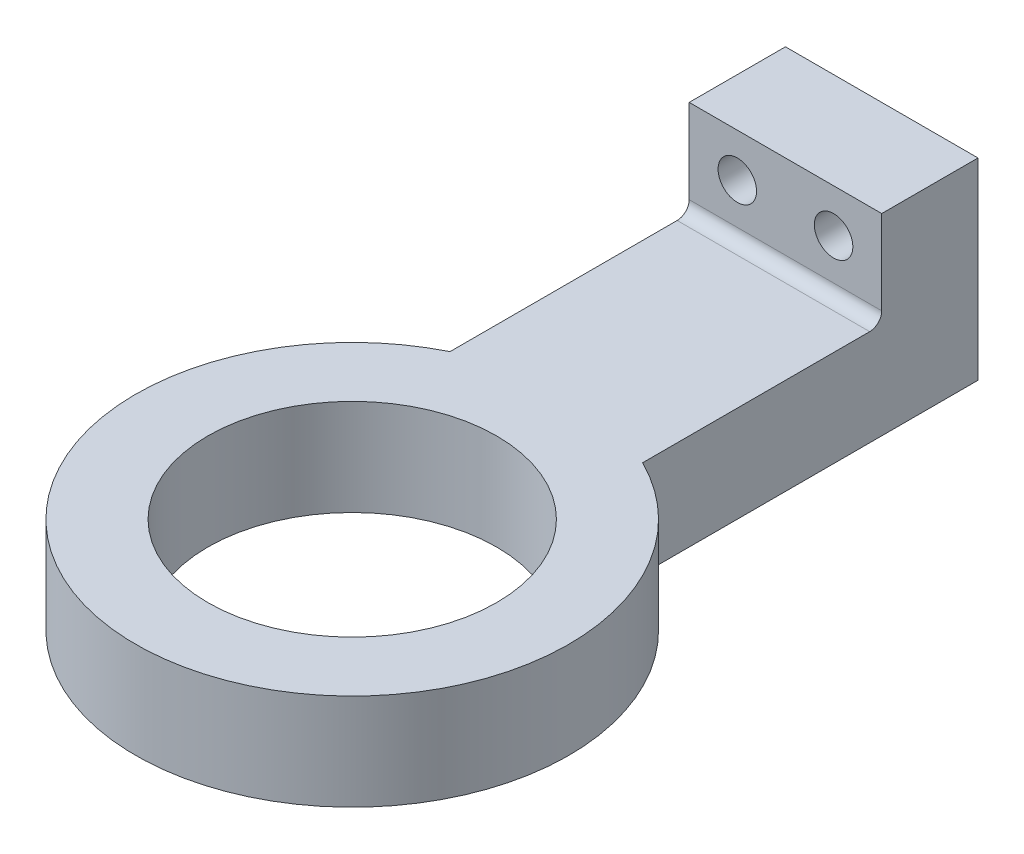
ISO-10303-21;
HEADER;
FILE_DESCRIPTION(('STEP AP214'),'2;1');
FILE_NAME('part.step','',(''),(''),'','','');
FILE_SCHEMA(('AUTOMOTIVE_DESIGN { 1 0 10303 214 1 1 1 1 }'));
ENDSEC;
DATA;
#1=APPLICATION_CONTEXT('core data for automotive mechanical design processes');
#2=APPLICATION_PROTOCOL_DEFINITION('international standard','automotive_design',2000,#1);
#3=PRODUCT_CONTEXT('',#1,'mechanical');
#4=PRODUCT('Part','Part','',(#3));
#5=PRODUCT_RELATED_PRODUCT_CATEGORY('part','',(#4));
#6=PRODUCT_DEFINITION_FORMATION('','',#4);
#7=PRODUCT_DEFINITION_CONTEXT('part definition',#1,'design');
#8=PRODUCT_DEFINITION('design','',#6,#7);
#9=PRODUCT_DEFINITION_SHAPE('','',#8);
#10=(LENGTH_UNIT() NAMED_UNIT(*) SI_UNIT(.MILLI.,.METRE.));
#11=(NAMED_UNIT(*) PLANE_ANGLE_UNIT() SI_UNIT($,.RADIAN.));
#12=(NAMED_UNIT(*) SI_UNIT($,.STERADIAN.) SOLID_ANGLE_UNIT());
#13=UNCERTAINTY_MEASURE_WITH_UNIT(LENGTH_MEASURE(1.E-05),#10,'distance_accuracy_value','');
#14=(GEOMETRIC_REPRESENTATION_CONTEXT(3) GLOBAL_UNCERTAINTY_ASSIGNED_CONTEXT((#13)) GLOBAL_UNIT_ASSIGNED_CONTEXT((#10,
#11,#12)) REPRESENTATION_CONTEXT('',''));
#15=CARTESIAN_POINT('',(0.,0.,0.));
#16=DIRECTION('',(0.,0.,1.));
#17=DIRECTION('',(1.,0.,0.));
#18=AXIS2_PLACEMENT_3D('',#15,#16,#17);
#19=CARTESIAN_POINT('',(0.,20.,0.));
#20=DIRECTION('',(0.,-1.,0.));
#21=DIRECTION('',(0.,0.,-1.));
#22=AXIS2_PLACEMENT_3D('',#19,#20,#21);
#23=CYLINDRICAL_SURFACE('',#22,45.);
#24=DIRECTION('',(0.,-1.,0.));
#25=VECTOR('',#24,1.);
#26=CARTESIAN_POINT('',(20.,20.,-40.3112887414927));
#27=LINE('',#26,#25);
#28=CARTESIAN_POINT('',(20.,20.,-40.3112887414927));
#29=VERTEX_POINT('',#28);
#30=CARTESIAN_POINT('',(20.,0.,-40.3112887414927));
#31=VERTEX_POINT('',#30);
#32=EDGE_CURVE('E151',#29,#31,#27,.T.);
#33=ORIENTED_EDGE('',*,*,#32,.F.);
#34=CARTESIAN_POINT('',(0.,20.,0.));
#35=DIRECTION('',(0.,1.,0.));
#36=DIRECTION('',(0.,0.,1.));
#37=AXIS2_PLACEMENT_3D('',#34,#35,#36);
#38=CIRCLE('',#37,45.);
#39=CARTESIAN_POINT('',(-20.,20.,-40.3112887414927));
#40=VERTEX_POINT('',#39);
#41=EDGE_CURVE('E143',#40,#29,#38,.T.);
#42=ORIENTED_EDGE('',*,*,#41,.F.);
#43=DIRECTION('',(0.,-1.,0.));
#44=VECTOR('',#43,1.);
#45=CARTESIAN_POINT('',(-20.,20.,-40.3112887414927));
#46=LINE('',#45,#44);
#47=CARTESIAN_POINT('',(-20.,0.,-40.3112887414927));
#48=VERTEX_POINT('',#47);
#49=EDGE_CURVE('E146',#48,#40,#46,.F.);
#50=ORIENTED_EDGE('',*,*,#49,.F.);
#51=CARTESIAN_POINT('',(0.,0.,0.));
#52=DIRECTION('',(0.,1.,0.));
#53=DIRECTION('',(0.,0.,1.));
#54=AXIS2_PLACEMENT_3D('',#51,#52,#53);
#55=CIRCLE('',#54,45.);
#56=EDGE_CURVE('E140',#48,#31,#55,.T.);
#57=ORIENTED_EDGE('',*,*,#56,.T.);
#58=EDGE_LOOP('',(#33,#42,#50,#57));
#59=FACE_BOUND('',#58,.T.);
#60=ADVANCED_FACE('F33',(#59),#23,.T.);
#61=CARTESIAN_POINT('',(0.,20.,0.));
#62=DIRECTION('',(0.,1.,0.));
#63=DIRECTION('',(0.,0.,1.));
#64=AXIS2_PLACEMENT_3D('',#61,#62,#63);
#65=PLANE('',#64);
#66=DIRECTION('',(0.,0.,-1.));
#67=VECTOR('',#66,1.);
#68=CARTESIAN_POINT('',(20.,20.,-110.));
#69=LINE('',#68,#67);
#70=CARTESIAN_POINT('',(20.,20.,-87.5));
#71=VERTEX_POINT('',#70);
#72=EDGE_CURVE('E129',#29,#71,#69,.T.);
#73=ORIENTED_EDGE('',*,*,#72,.T.);
#74=DIRECTION('',(1.,0.,0.));
#75=VECTOR('',#74,1.);
#76=CARTESIAN_POINT('',(0.,20.,-87.5));
#77=LINE('',#76,#75);
#78=CARTESIAN_POINT('',(-20.,20.,-87.5));
#79=VERTEX_POINT('',#78);
#80=EDGE_CURVE('E54',#71,#79,#77,.F.);
#81=ORIENTED_EDGE('',*,*,#80,.T.);
#82=DIRECTION('',(0.,0.,1.));
#83=VECTOR('',#82,1.);
#84=CARTESIAN_POINT('',(-20.,20.,-110.));
#85=LINE('',#84,#83);
#86=EDGE_CURVE('E132',#79,#40,#85,.T.);
#87=ORIENTED_EDGE('',*,*,#86,.T.);
#88=ORIENTED_EDGE('',*,*,#41,.T.);
#89=EDGE_LOOP('',(#73,#81,#87,#88));
#90=FACE_BOUND('',#89,.T.);
#91=CARTESIAN_POINT('',(0.,20.,0.));
#92=DIRECTION('',(0.,1.,0.));
#93=DIRECTION('',(0.,0.,1.));
#94=AXIS2_PLACEMENT_3D('',#91,#92,#93);
#95=CIRCLE('',#94,30.);
#96=CARTESIAN_POINT('',(0.,20.,30.));
#97=VERTEX_POINT('',#96);
#98=EDGE_CURVE('E137',#97,#97,#95,.T.);
#99=ORIENTED_EDGE('',*,*,#98,.F.);
#100=EDGE_LOOP('',(#99));
#101=FACE_BOUND('',#100,.T.);
#102=ADVANCED_FACE('F166',(#90,#101),#65,.T.);
#103=CARTESIAN_POINT('',(0.,0.,0.));
#104=DIRECTION('',(0.,1.,0.));
#105=DIRECTION('',(0.,0.,1.));
#106=AXIS2_PLACEMENT_3D('',#103,#104,#105);
#107=PLANE('',#106);
#108=ORIENTED_EDGE('',*,*,#56,.F.);
#109=DIRECTION('',(0.,0.,1.));
#110=VECTOR('',#109,1.);
#111=CARTESIAN_POINT('',(-20.,0.,-110.));
#112=LINE('',#111,#110);
#113=CARTESIAN_POINT('',(-20.,0.,-110.));
#114=VERTEX_POINT('',#113);
#115=EDGE_CURVE('E127',#114,#48,#112,.T.);
#116=ORIENTED_EDGE('',*,*,#115,.F.);
#117=DIRECTION('',(-1.,0.,0.));
#118=VECTOR('',#117,1.);
#119=CARTESIAN_POINT('',(-20.,0.,-110.));
#120=LINE('',#119,#118);
#121=CARTESIAN_POINT('',(20.,0.,-110.));
#122=VERTEX_POINT('',#121);
#123=EDGE_CURVE('E99',#122,#114,#120,.T.);
#124=ORIENTED_EDGE('',*,*,#123,.F.);
#125=DIRECTION('',(0.,0.,-1.));
#126=VECTOR('',#125,1.);
#127=CARTESIAN_POINT('',(20.,0.,-110.));
#128=LINE('',#127,#126);
#129=EDGE_CURVE('E95',#31,#122,#128,.T.);
#130=ORIENTED_EDGE('',*,*,#129,.F.);
#131=EDGE_LOOP('',(#108,#116,#124,#130));
#132=FACE_BOUND('',#131,.T.);
#133=CARTESIAN_POINT('',(0.,0.,0.));
#134=DIRECTION('',(0.,1.,0.));
#135=DIRECTION('',(0.,0.,1.));
#136=AXIS2_PLACEMENT_3D('',#133,#134,#135);
#137=CIRCLE('',#136,30.);
#138=CARTESIAN_POINT('',(0.,0.,30.));
#139=VERTEX_POINT('',#138);
#140=EDGE_CURVE('E134',#139,#139,#137,.T.);
#141=ORIENTED_EDGE('',*,*,#140,.T.);
#142=EDGE_LOOP('',(#141));
#143=FACE_BOUND('',#142,.T.);
#144=ADVANCED_FACE('F172',(#132,#143),#107,.F.);
#145=CARTESIAN_POINT('',(0.,20.,0.));
#146=DIRECTION('',(0.,-1.,0.));
#147=DIRECTION('',(0.,0.,-1.));
#148=AXIS2_PLACEMENT_3D('',#145,#146,#147);
#149=CYLINDRICAL_SURFACE('',#148,30.);
#150=ORIENTED_EDGE('',*,*,#140,.F.);
#151=EDGE_LOOP('',(#150));
#152=FACE_BOUND('',#151,.T.);
#153=ORIENTED_EDGE('',*,*,#98,.T.);
#154=EDGE_LOOP('',(#153));
#155=FACE_BOUND('',#154,.T.);
#156=ADVANCED_FACE('F176',(#152,#155),#149,.F.);
#157=CARTESIAN_POINT('',(20.,109.442719099992,-110.));
#158=DIRECTION('',(-1.,0.,0.));
#159=DIRECTION('',(0.,0.,1.));
#160=AXIS2_PLACEMENT_3D('',#157,#158,#159);
#161=PLANE('',#160);
#162=ORIENTED_EDGE('',*,*,#72,.F.);
#163=ORIENTED_EDGE('',*,*,#32,.T.);
#164=ORIENTED_EDGE('',*,*,#129,.T.);
#165=DIRECTION('',(0.,-1.,0.));
#166=VECTOR('',#165,1.);
#167=CARTESIAN_POINT('',(20.,109.442719099992,-110.));
#168=LINE('',#167,#166);
#169=CARTESIAN_POINT('',(20.,40.,-110.));
#170=VERTEX_POINT('',#169);
#171=EDGE_CURVE('E89',#170,#122,#168,.T.);
#172=ORIENTED_EDGE('',*,*,#171,.F.);
#173=DIRECTION('',(0.,0.,-1.));
#174=VECTOR('',#173,1.);
#175=CARTESIAN_POINT('',(20.,40.,-90.));
#176=LINE('',#175,#174);
#177=CARTESIAN_POINT('',(20.,40.,-90.));
#178=VERTEX_POINT('',#177);
#179=EDGE_CURVE('E93',#178,#170,#176,.T.);
#180=ORIENTED_EDGE('',*,*,#179,.F.);
#181=DIRECTION('',(0.,-1.,0.));
#182=VECTOR('',#181,1.);
#183=CARTESIAN_POINT('',(20.,40.,-90.));
#184=LINE('',#183,#182);
#185=CARTESIAN_POINT('',(20.,22.5,-90.));
#186=VERTEX_POINT('',#185);
#187=EDGE_CURVE('E122',#178,#186,#184,.T.);
#188=ORIENTED_EDGE('',*,*,#187,.T.);
#189=CARTESIAN_POINT('',(20.,22.5,-87.5));
#190=DIRECTION('',(-1.,0.,0.));
#191=DIRECTION('',(0.,0.,1.));
#192=AXIS2_PLACEMENT_3D('',#189,#190,#191);
#193=CIRCLE('',#192,2.5);
#194=EDGE_CURVE('E41',#186,#71,#193,.T.);
#195=ORIENTED_EDGE('',*,*,#194,.T.);
#196=EDGE_LOOP('',(#162,#163,#164,#172,#180,#188,#195));
#197=FACE_BOUND('',#196,.T.);
#198=ADVANCED_FACE('F91',(#197),#161,.F.);
#199=CARTESIAN_POINT('',(-20.,109.442719099992,-110.));
#200=DIRECTION('',(1.,0.,0.));
#201=DIRECTION('',(0.,0.,-1.));
#202=AXIS2_PLACEMENT_3D('',#199,#200,#201);
#203=PLANE('',#202);
#204=ORIENTED_EDGE('',*,*,#115,.T.);
#205=ORIENTED_EDGE('',*,*,#49,.T.);
#206=ORIENTED_EDGE('',*,*,#86,.F.);
#207=CARTESIAN_POINT('',(-20.,22.5,-87.5));
#208=DIRECTION('',(1.,0.,0.));
#209=DIRECTION('',(0.,0.,-1.));
#210=AXIS2_PLACEMENT_3D('',#207,#208,#209);
#211=CIRCLE('',#210,2.5);
#212=CARTESIAN_POINT('',(-20.,22.5,-90.));
#213=VERTEX_POINT('',#212);
#214=EDGE_CURVE('E11',#79,#213,#211,.T.);
#215=ORIENTED_EDGE('',*,*,#214,.T.);
#216=DIRECTION('',(0.,-1.,0.));
#217=VECTOR('',#216,1.);
#218=CARTESIAN_POINT('',(-20.,40.,-90.));
#219=LINE('',#218,#217);
#220=CARTESIAN_POINT('',(-20.,40.,-90.));
#221=VERTEX_POINT('',#220);
#222=EDGE_CURVE('E124',#221,#213,#219,.T.);
#223=ORIENTED_EDGE('',*,*,#222,.F.);
#224=DIRECTION('',(0.,0.,1.));
#225=VECTOR('',#224,1.);
#226=CARTESIAN_POINT('',(-20.,40.,-90.));
#227=LINE('',#226,#225);
#228=CARTESIAN_POINT('',(-20.,40.,-110.));
#229=VERTEX_POINT('',#228);
#230=EDGE_CURVE('E107',#229,#221,#227,.T.);
#231=ORIENTED_EDGE('',*,*,#230,.F.);
#232=DIRECTION('',(0.,-1.,0.));
#233=VECTOR('',#232,1.);
#234=CARTESIAN_POINT('',(-20.,109.442719099992,-110.));
#235=LINE('',#234,#233);
#236=EDGE_CURVE('E104',#229,#114,#235,.T.);
#237=ORIENTED_EDGE('',*,*,#236,.T.);
#238=EDGE_LOOP('',(#204,#205,#206,#215,#223,#231,#237));
#239=FACE_BOUND('',#238,.T.);
#240=ADVANCED_FACE('F163',(#239),#203,.F.);
#241=CARTESIAN_POINT('',(-20.,109.442719099992,-110.));
#242=DIRECTION('',(0.,0.,1.));
#243=DIRECTION('',(1.,0.,0.));
#244=AXIS2_PLACEMENT_3D('',#241,#242,#243);
#245=PLANE('',#244);
#246=CARTESIAN_POINT('',(-10.,31.,-110.));
#247=DIRECTION('',(0.,0.,1.));
#248=DIRECTION('',(1.,0.,0.));
#249=AXIS2_PLACEMENT_3D('',#246,#247,#248);
#250=CIRCLE('',#249,4.);
#251=CARTESIAN_POINT('',(-6.00000000000001,31.,-110.));
#252=VERTEX_POINT('',#251);
#253=EDGE_CURVE('E214',#252,#252,#250,.T.);
#254=ORIENTED_EDGE('',*,*,#253,.T.);
#255=EDGE_LOOP('',(#254));
#256=FACE_BOUND('',#255,.T.);
#257=CARTESIAN_POINT('',(10.,31.,-110.));
#258=DIRECTION('',(0.,0.,1.));
#259=DIRECTION('',(1.,0.,0.));
#260=AXIS2_PLACEMENT_3D('',#257,#258,#259);
#261=CIRCLE('',#260,4.);
#262=CARTESIAN_POINT('',(14.,31.,-110.));
#263=VERTEX_POINT('',#262);
#264=EDGE_CURVE('E113',#263,#263,#261,.T.);
#265=ORIENTED_EDGE('',*,*,#264,.T.);
#266=EDGE_LOOP('',(#265));
#267=FACE_BOUND('',#266,.T.);
#268=ORIENTED_EDGE('',*,*,#236,.F.);
#269=DIRECTION('',(-1.,0.,0.));
#270=VECTOR('',#269,1.);
#271=CARTESIAN_POINT('',(-20.,40.,-110.));
#272=LINE('',#271,#270);
#273=EDGE_CURVE('E102',#170,#229,#272,.T.);
#274=ORIENTED_EDGE('',*,*,#273,.F.);
#275=ORIENTED_EDGE('',*,*,#171,.T.);
#276=ORIENTED_EDGE('',*,*,#123,.T.);
#277=EDGE_LOOP('',(#268,#274,#275,#276));
#278=FACE_BOUND('',#277,.T.);
#279=ADVANCED_FACE('F103',(#256,#267,#278),#245,.F.);
#280=CARTESIAN_POINT('',(-20.,40.,-90.));
#281=DIRECTION('',(0.,0.,-1.));
#282=DIRECTION('',(-1.,0.,0.));
#283=AXIS2_PLACEMENT_3D('',#280,#281,#282);
#284=PLANE('',#283);
#285=CARTESIAN_POINT('',(-10.,31.,-90.));
#286=DIRECTION('',(0.,0.,1.));
#287=DIRECTION('',(1.,0.,0.));
#288=AXIS2_PLACEMENT_3D('',#285,#286,#287);
#289=CIRCLE('',#288,4.);
#290=CARTESIAN_POINT('',(-6.00000000000001,31.,-90.));
#291=VERTEX_POINT('',#290);
#292=EDGE_CURVE('E217',#291,#291,#289,.T.);
#293=ORIENTED_EDGE('',*,*,#292,.F.);
#294=EDGE_LOOP('',(#293));
#295=FACE_BOUND('',#294,.T.);
#296=CARTESIAN_POINT('',(10.,31.,-90.));
#297=DIRECTION('',(0.,0.,1.));
#298=DIRECTION('',(1.,0.,0.));
#299=AXIS2_PLACEMENT_3D('',#296,#297,#298);
#300=CIRCLE('',#299,4.);
#301=CARTESIAN_POINT('',(14.,31.,-90.));
#302=VERTEX_POINT('',#301);
#303=EDGE_CURVE('E116',#302,#302,#300,.T.);
#304=ORIENTED_EDGE('',*,*,#303,.F.);
#305=EDGE_LOOP('',(#304));
#306=FACE_BOUND('',#305,.T.);
#307=ORIENTED_EDGE('',*,*,#222,.T.);
#308=DIRECTION('',(1.,0.,0.));
#309=VECTOR('',#308,1.);
#310=CARTESIAN_POINT('',(-20.,22.5,-90.));
#311=LINE('',#310,#309);
#312=EDGE_CURVE('E153',#213,#186,#311,.T.);
#313=ORIENTED_EDGE('',*,*,#312,.T.);
#314=ORIENTED_EDGE('',*,*,#187,.F.);
#315=DIRECTION('',(1.,0.,0.));
#316=VECTOR('',#315,1.);
#317=CARTESIAN_POINT('',(-20.,40.,-90.));
#318=LINE('',#317,#316);
#319=EDGE_CURVE('E111',#221,#178,#318,.T.);
#320=ORIENTED_EDGE('',*,*,#319,.F.);
#321=EDGE_LOOP('',(#307,#313,#314,#320));
#322=FACE_BOUND('',#321,.T.);
#323=ADVANCED_FACE('F158',(#295,#306,#322),#284,.F.);
#324=CARTESIAN_POINT('',(0.,40.,0.));
#325=DIRECTION('',(0.,-1.,0.));
#326=DIRECTION('',(0.,0.,-1.));
#327=AXIS2_PLACEMENT_3D('',#324,#325,#326);
#328=PLANE('',#327);
#329=ORIENTED_EDGE('',*,*,#179,.T.);
#330=ORIENTED_EDGE('',*,*,#273,.T.);
#331=ORIENTED_EDGE('',*,*,#230,.T.);
#332=ORIENTED_EDGE('',*,*,#319,.T.);
#333=EDGE_LOOP('',(#329,#330,#331,#332));
#334=FACE_BOUND('',#333,.T.);
#335=ADVANCED_FACE('F109',(#334),#328,.F.);
#336=CARTESIAN_POINT('',(-20.,22.5,-87.5));
#337=DIRECTION('',(1.,0.,0.));
#338=DIRECTION('',(0.,0.,-1.));
#339=AXIS2_PLACEMENT_3D('',#336,#337,#338);
#340=CYLINDRICAL_SURFACE('',#339,2.5);
#341=ORIENTED_EDGE('',*,*,#214,.F.);
#342=ORIENTED_EDGE('',*,*,#80,.F.);
#343=ORIENTED_EDGE('',*,*,#194,.F.);
#344=ORIENTED_EDGE('',*,*,#312,.F.);
#345=EDGE_LOOP('',(#341,#342,#343,#344));
#346=FACE_BOUND('',#345,.T.);
#347=ADVANCED_FACE('F35',(#346),#340,.F.);
#348=CARTESIAN_POINT('',(10.,31.,-110.));
#349=DIRECTION('',(0.,0.,1.));
#350=DIRECTION('',(1.,0.,0.));
#351=AXIS2_PLACEMENT_3D('',#348,#349,#350);
#352=CYLINDRICAL_SURFACE('',#351,4.);
#353=ORIENTED_EDGE('',*,*,#264,.F.);
#354=EDGE_LOOP('',(#353));
#355=FACE_BOUND('',#354,.T.);
#356=ORIENTED_EDGE('',*,*,#303,.T.);
#357=EDGE_LOOP('',(#356));
#358=FACE_BOUND('',#357,.T.);
#359=ADVANCED_FACE('F202',(#355,#358),#352,.F.);
#360=CARTESIAN_POINT('',(-10.,31.,-110.));
#361=DIRECTION('',(0.,0.,1.));
#362=DIRECTION('',(1.,0.,0.));
#363=AXIS2_PLACEMENT_3D('',#360,#361,#362);
#364=CYLINDRICAL_SURFACE('',#363,4.);
#365=ORIENTED_EDGE('',*,*,#253,.F.);
#366=EDGE_LOOP('',(#365));
#367=FACE_BOUND('',#366,.T.);
#368=ORIENTED_EDGE('',*,*,#292,.T.);
#369=EDGE_LOOP('',(#368));
#370=FACE_BOUND('',#369,.T.);
#371=ADVANCED_FACE('F205',(#367,#370),#364,.F.);
#372=CLOSED_SHELL('',(#60,#102,#144,#156,#198,#240,#279,#323,#335,#347,#359,#371));
#373=MANIFOLD_SOLID_BREP('B2',#372);
#374=ADVANCED_BREP_SHAPE_REPRESENTATION('',(#18,#373),#14);
#375=SHAPE_DEFINITION_REPRESENTATION(#9,#374);
ENDSEC;
END-ISO-10303-21;
